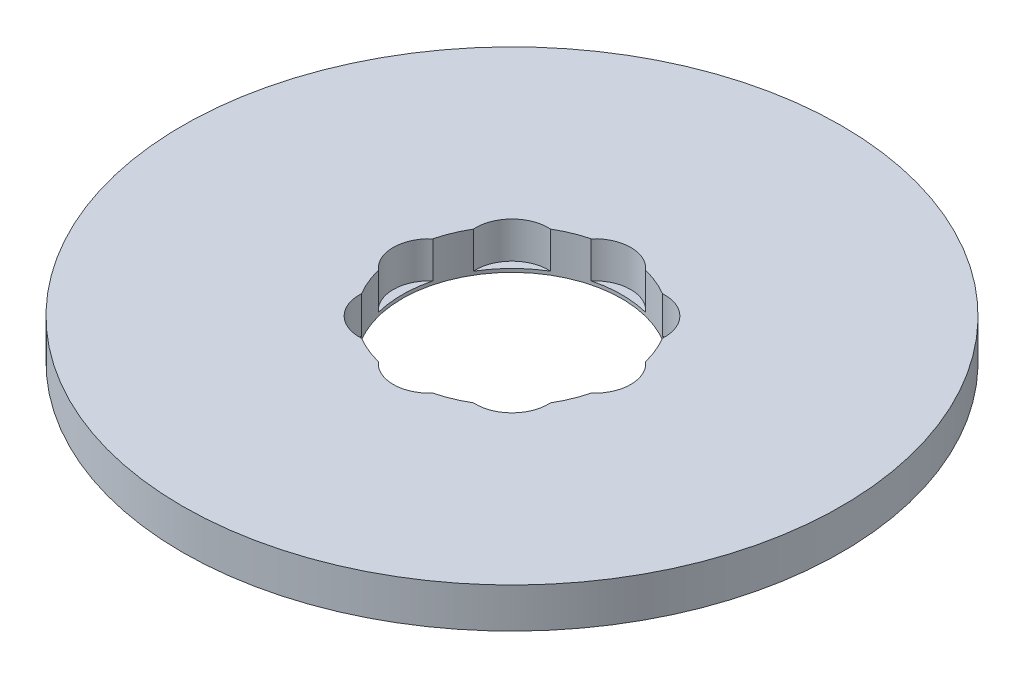
ISO-10303-21;
HEADER;
FILE_DESCRIPTION(('STEP AP214'),'2;1');
FILE_NAME('part.step','',(''),(''),'','','');
FILE_SCHEMA(('AUTOMOTIVE_DESIGN { 1 0 10303 214 1 1 1 1 }'));
ENDSEC;
DATA;
#1=APPLICATION_CONTEXT('core data for automotive mechanical design processes');
#2=APPLICATION_PROTOCOL_DEFINITION('international standard','automotive_design',2000,#1);
#3=PRODUCT_CONTEXT('',#1,'mechanical');
#4=PRODUCT('Part','Part','',(#3));
#5=PRODUCT_RELATED_PRODUCT_CATEGORY('part','',(#4));
#6=PRODUCT_DEFINITION_FORMATION('','',#4);
#7=PRODUCT_DEFINITION_CONTEXT('part definition',#1,'design');
#8=PRODUCT_DEFINITION('design','',#6,#7);
#9=PRODUCT_DEFINITION_SHAPE('','',#8);
#10=(LENGTH_UNIT() NAMED_UNIT(*) SI_UNIT(.MILLI.,.METRE.));
#11=(NAMED_UNIT(*) PLANE_ANGLE_UNIT() SI_UNIT($,.RADIAN.));
#12=(NAMED_UNIT(*) SI_UNIT($,.STERADIAN.) SOLID_ANGLE_UNIT());
#13=UNCERTAINTY_MEASURE_WITH_UNIT(LENGTH_MEASURE(1.E-05),#10,'distance_accuracy_value','');
#14=(GEOMETRIC_REPRESENTATION_CONTEXT(3) GLOBAL_UNCERTAINTY_ASSIGNED_CONTEXT((#13)) GLOBAL_UNIT_ASSIGNED_CONTEXT((#10,
#11,#12)) REPRESENTATION_CONTEXT('',''));
#15=CARTESIAN_POINT('',(0.,0.,0.));
#16=DIRECTION('',(0.,0.,1.));
#17=DIRECTION('',(1.,0.,0.));
#18=AXIS2_PLACEMENT_3D('',#15,#16,#17);
#19=CARTESIAN_POINT('',(0.,10.,0.));
#20=DIRECTION('',(0.,-1.,0.));
#21=DIRECTION('',(0.,0.,-1.));
#22=AXIS2_PLACEMENT_3D('',#19,#20,#21);
#23=CYLINDRICAL_SURFACE('',#22,82.5);
#24=CARTESIAN_POINT('',(0.,10.,0.));
#25=DIRECTION('',(0.,1.,0.));
#26=DIRECTION('',(0.,0.,1.));
#27=AXIS2_PLACEMENT_3D('',#24,#25,#26);
#28=CIRCLE('',#27,82.5);
#29=CARTESIAN_POINT('',(0.,10.,82.5));
#30=VERTEX_POINT('',#29);
#31=EDGE_CURVE('E263',#30,#30,#28,.T.);
#32=ORIENTED_EDGE('',*,*,#31,.F.);
#33=EDGE_LOOP('',(#32));
#34=FACE_BOUND('',#33,.T.);
#35=CARTESIAN_POINT('',(0.,0.,0.));
#36=DIRECTION('',(0.,1.,0.));
#37=DIRECTION('',(0.,0.,1.));
#38=AXIS2_PLACEMENT_3D('',#35,#36,#37);
#39=CIRCLE('',#38,82.5);
#40=CARTESIAN_POINT('',(0.,0.,82.5));
#41=VERTEX_POINT('',#40);
#42=EDGE_CURVE('E256',#41,#41,#39,.T.);
#43=ORIENTED_EDGE('',*,*,#42,.T.);
#44=EDGE_LOOP('',(#43));
#45=FACE_BOUND('',#44,.T.);
#46=ADVANCED_FACE('F39',(#34,#45),#23,.T.);
#47=CARTESIAN_POINT('',(0.,10.,0.));
#48=DIRECTION('',(0.,1.,0.));
#49=DIRECTION('',(0.,0.,1.));
#50=AXIS2_PLACEMENT_3D('',#47,#48,#49);
#51=PLANE('',#50);
#52=CARTESIAN_POINT('',(-14.5853738011501,10.,14.5853738011502));
#53=DIRECTION('',(0.,1.,0.));
#54=DIRECTION('',(0.707106781186549,0.,0.707106781186546));
#55=AXIS2_PLACEMENT_3D('',#52,#53,#54);
#56=CIRCLE('',#55,9.0957152545966);
#57=CARTESIAN_POINT('',(-23.6629507323252,10.,14.0112370131816));
#58=VERTEX_POINT('',#57);
#59=CARTESIAN_POINT('',(-14.0112370131815,10.,23.6629507323253));
#60=VERTEX_POINT('',#59);
#61=EDGE_CURVE('E246',#58,#60,#56,.T.);
#62=ORIENTED_EDGE('',*,*,#61,.F.);
#63=CARTESIAN_POINT('',(0.,10.,0.));
#64=DIRECTION('',(0.,1.,0.));
#65=DIRECTION('',(0.,0.,1.));
#66=AXIS2_PLACEMENT_3D('',#63,#64,#65);
#67=CIRCLE('',#66,27.5);
#68=CARTESIAN_POINT('',(-26.639673630543,10.,6.82479222087777));
#69=VERTEX_POINT('',#68);
#70=EDGE_CURVE('E254',#69,#58,#67,.T.);
#71=ORIENTED_EDGE('',*,*,#70,.F.);
#72=CARTESIAN_POINT('',(-20.6268334418678,10.,0.));
#73=DIRECTION('',(0.,1.,0.));
#74=DIRECTION('',(0.,0.,1.));
#75=AXIS2_PLACEMENT_3D('',#72,#73,#74);
#76=CIRCLE('',#75,9.0957152545966);
#77=CARTESIAN_POINT('',(-26.639673630543,10.,-6.82479222087777));
#78=VERTEX_POINT('',#77);
#79=EDGE_CURVE('E248',#78,#69,#76,.T.);
#80=ORIENTED_EDGE('',*,*,#79,.F.);
#81=CARTESIAN_POINT('',(-23.6629507323254,10.,-14.0112370131812));
#82=VERTEX_POINT('',#81);
#83=EDGE_CURVE('E257',#82,#78,#67,.T.);
#84=ORIENTED_EDGE('',*,*,#83,.F.);
#85=CARTESIAN_POINT('',(-14.5853738011503,10.,-14.58537380115));
#86=DIRECTION('',(0.,1.,0.));
#87=DIRECTION('',(-0.707106781186539,0.,0.707106781186556));
#88=AXIS2_PLACEMENT_3D('',#85,#86,#87);
#89=CIRCLE('',#88,9.0957152545966);
#90=CARTESIAN_POINT('',(-14.0112370131818,10.,-23.6629507323251));
#91=VERTEX_POINT('',#90);
#92=EDGE_CURVE('E58',#91,#82,#89,.T.);
#93=ORIENTED_EDGE('',*,*,#92,.F.);
#94=CARTESIAN_POINT('',(-6.82479222087805,10.,-26.6396736305429));
#95=VERTEX_POINT('',#94);
#96=EDGE_CURVE('E168',#95,#91,#67,.T.);
#97=ORIENTED_EDGE('',*,*,#96,.F.);
#98=CARTESIAN_POINT('',(-2.1605461212512E-13,10.,-20.6268334418678));
#99=DIRECTION('',(0.,1.,0.));
#100=DIRECTION('',(-1.,0.,0.));
#101=AXIS2_PLACEMENT_3D('',#98,#99,#100);
#102=CIRCLE('',#101,9.0957152545966);
#103=CARTESIAN_POINT('',(6.82479222087748,10.,-26.639673630543));
#104=VERTEX_POINT('',#103);
#105=EDGE_CURVE('E165',#104,#95,#102,.T.);
#106=ORIENTED_EDGE('',*,*,#105,.F.);
#107=CARTESIAN_POINT('',(14.0112370131813,10.,-23.6629507323254));
#108=VERTEX_POINT('',#107);
#109=EDGE_CURVE('E604',#108,#104,#67,.T.);
#110=ORIENTED_EDGE('',*,*,#109,.F.);
#111=CARTESIAN_POINT('',(14.58537380115,10.,-14.5853738011503));
#112=DIRECTION('',(0.,1.,0.));
#113=DIRECTION('',(-0.707106781186554,0.,-0.707106781186541));
#114=AXIS2_PLACEMENT_3D('',#111,#112,#113);
#115=CIRCLE('',#114,9.0957152545966);
#116=CARTESIAN_POINT('',(23.6629507323251,10.,-14.0112370131817));
#117=VERTEX_POINT('',#116);
#118=EDGE_CURVE('E224',#117,#108,#115,.T.);
#119=ORIENTED_EDGE('',*,*,#118,.F.);
#120=CARTESIAN_POINT('',(26.639673630543,10.,-6.82479222087776));
#121=VERTEX_POINT('',#120);
#122=EDGE_CURVE('E605',#121,#117,#67,.T.);
#123=ORIENTED_EDGE('',*,*,#122,.F.);
#124=CARTESIAN_POINT('',(20.6268334418678,10.,0.));
#125=DIRECTION('',(0.,1.,0.));
#126=DIRECTION('',(0.,0.,-1.));
#127=AXIS2_PLACEMENT_3D('',#124,#125,#126);
#128=CIRCLE('',#127,9.0957152545966);
#129=CARTESIAN_POINT('',(26.639673630543,10.,6.82479222087776));
#130=VERTEX_POINT('',#129);
#131=EDGE_CURVE('E231',#130,#121,#128,.T.);
#132=ORIENTED_EDGE('',*,*,#131,.F.);
#133=CARTESIAN_POINT('',(23.6629507323253,10.,14.0112370131814));
#134=VERTEX_POINT('',#133);
#135=EDGE_CURVE('E599',#134,#130,#67,.T.);
#136=ORIENTED_EDGE('',*,*,#135,.F.);
#137=CARTESIAN_POINT('',(14.5853738011502,10.,14.5853738011501));
#138=DIRECTION('',(0.,1.,0.));
#139=DIRECTION('',(0.707106781186544,0.,-0.707106781186551));
#140=AXIS2_PLACEMENT_3D('',#137,#138,#139);
#141=CIRCLE('',#140,9.0957152545966);
#142=CARTESIAN_POINT('',(14.0112370131816,10.,23.6629507323252));
#143=VERTEX_POINT('',#142);
#144=EDGE_CURVE('E237',#143,#134,#141,.T.);
#145=ORIENTED_EDGE('',*,*,#144,.F.);
#146=CARTESIAN_POINT('',(6.82479222087786,10.,26.6396736305429));
#147=VERTEX_POINT('',#146);
#148=EDGE_CURVE('E598',#147,#143,#67,.T.);
#149=ORIENTED_EDGE('',*,*,#148,.F.);
#150=CARTESIAN_POINT('',(0.,10.,20.6268334418678));
#151=DIRECTION('',(0.,1.,0.));
#152=DIRECTION('',(1.,0.,0.));
#153=AXIS2_PLACEMENT_3D('',#150,#151,#152);
#154=CIRCLE('',#153,9.0957152545966);
#155=CARTESIAN_POINT('',(-6.82479222087767,10.,26.639673630543));
#156=VERTEX_POINT('',#155);
#157=EDGE_CURVE('E241',#156,#147,#154,.T.);
#158=ORIENTED_EDGE('',*,*,#157,.F.);
#159=EDGE_CURVE('E259',#60,#156,#67,.T.);
#160=ORIENTED_EDGE('',*,*,#159,.F.);
#161=EDGE_LOOP('',(#62,#71,#80,#84,#93,#97,#106,#110,#119,#123,#132,#136,#145,#149,#158,#160));
#162=FACE_BOUND('',#161,.T.);
#163=ORIENTED_EDGE('',*,*,#31,.T.);
#164=EDGE_LOOP('',(#163));
#165=FACE_BOUND('',#164,.T.);
#166=ADVANCED_FACE('F286',(#162,#165),#51,.T.);
#167=CARTESIAN_POINT('',(0.,0.,0.));
#168=DIRECTION('',(0.,1.,0.));
#169=DIRECTION('',(0.,0.,1.));
#170=AXIS2_PLACEMENT_3D('',#167,#168,#169);
#171=PLANE('',#170);
#172=CARTESIAN_POINT('',(0.,0.,0.));
#173=DIRECTION('',(0.,1.,0.));
#174=DIRECTION('',(0.,0.,1.));
#175=AXIS2_PLACEMENT_3D('',#172,#173,#174);
#176=CIRCLE('',#175,27.5);
#177=CARTESIAN_POINT('',(0.,0.,27.5));
#178=VERTEX_POINT('',#177);
#179=EDGE_CURVE('E251',#178,#178,#176,.T.);
#180=ORIENTED_EDGE('',*,*,#179,.T.);
#181=EDGE_LOOP('',(#180));
#182=FACE_BOUND('',#181,.T.);
#183=ORIENTED_EDGE('',*,*,#42,.F.);
#184=EDGE_LOOP('',(#183));
#185=FACE_BOUND('',#184,.T.);
#186=ADVANCED_FACE('F308',(#182,#185),#171,.F.);
#187=CARTESIAN_POINT('',(0.,10.,0.));
#188=DIRECTION('',(0.,-1.,0.));
#189=DIRECTION('',(0.,0.,-1.));
#190=AXIS2_PLACEMENT_3D('',#187,#188,#189);
#191=CYLINDRICAL_SURFACE('',#190,27.5);
#192=DIRECTION('',(0.,1.,0.));
#193=VECTOR('',#192,1.);
#194=CARTESIAN_POINT('',(-23.6629507323252,5.43177677871555,14.0112370131816));
#195=LINE('',#194,#193);
#196=CARTESIAN_POINT('',(-23.6629507323252,0.863553557431104,14.0112370131816));
#197=VERTEX_POINT('',#196);
#198=EDGE_CURVE('E11',#197,#58,#195,.T.);
#199=ORIENTED_EDGE('',*,*,#198,.F.);
#200=CARTESIAN_POINT('',(0.,0.863553557431104,0.));
#201=DIRECTION('',(0.,1.,0.));
#202=DIRECTION('',(0.,0.,1.));
#203=AXIS2_PLACEMENT_3D('',#200,#201,#202);
#204=CIRCLE('',#203,27.5);
#205=CARTESIAN_POINT('',(-14.0112370131815,0.863553557431104,23.6629507323253));
#206=VERTEX_POINT('',#205);
#207=EDGE_CURVE('E157',#197,#206,#204,.T.);
#208=ORIENTED_EDGE('',*,*,#207,.T.);
#209=DIRECTION('',(0.,1.,0.));
#210=VECTOR('',#209,1.);
#211=CARTESIAN_POINT('',(-14.0112370131815,5.43177677871555,23.6629507323253));
#212=LINE('',#211,#210);
#213=EDGE_CURVE('E46',#60,#206,#212,.F.);
#214=ORIENTED_EDGE('',*,*,#213,.F.);
#215=ORIENTED_EDGE('',*,*,#159,.T.);
#216=DIRECTION('',(0.,1.,0.));
#217=VECTOR('',#216,1.);
#218=CARTESIAN_POINT('',(-6.82479222087767,5.43177677871555,26.639673630543));
#219=LINE('',#218,#217);
#220=CARTESIAN_POINT('',(-6.82479222087767,0.863553557431104,26.639673630543));
#221=VERTEX_POINT('',#220);
#222=EDGE_CURVE('E198',#221,#156,#219,.T.);
#223=ORIENTED_EDGE('',*,*,#222,.F.);
#224=CARTESIAN_POINT('',(6.82479222087786,0.863553557431104,26.6396736305429));
#225=VERTEX_POINT('',#224);
#226=EDGE_CURVE('E194',#221,#225,#204,.T.);
#227=ORIENTED_EDGE('',*,*,#226,.T.);
#228=DIRECTION('',(0.,1.,0.));
#229=VECTOR('',#228,1.);
#230=CARTESIAN_POINT('',(6.82479222087786,5.43177677871555,26.6396736305429));
#231=LINE('',#230,#229);
#232=EDGE_CURVE('E192',#147,#225,#231,.F.);
#233=ORIENTED_EDGE('',*,*,#232,.F.);
#234=ORIENTED_EDGE('',*,*,#148,.T.);
#235=DIRECTION('',(0.,1.,0.));
#236=VECTOR('',#235,1.);
#237=CARTESIAN_POINT('',(14.0112370131816,5.43177677871555,23.6629507323252));
#238=LINE('',#237,#236);
#239=CARTESIAN_POINT('',(14.0112370131816,0.863553557431104,23.6629507323252));
#240=VERTEX_POINT('',#239);
#241=EDGE_CURVE('E191',#240,#143,#238,.T.);
#242=ORIENTED_EDGE('',*,*,#241,.F.);
#243=CARTESIAN_POINT('',(23.6629507323253,0.863553557431104,14.0112370131814));
#244=VERTEX_POINT('',#243);
#245=EDGE_CURVE('E189',#240,#244,#204,.T.);
#246=ORIENTED_EDGE('',*,*,#245,.T.);
#247=DIRECTION('',(0.,1.,0.));
#248=VECTOR('',#247,1.);
#249=CARTESIAN_POINT('',(23.6629507323253,5.43177677871555,14.0112370131814));
#250=LINE('',#249,#248);
#251=EDGE_CURVE('E187',#134,#244,#250,.F.);
#252=ORIENTED_EDGE('',*,*,#251,.F.);
#253=ORIENTED_EDGE('',*,*,#135,.T.);
#254=DIRECTION('',(0.,1.,0.));
#255=VECTOR('',#254,1.);
#256=CARTESIAN_POINT('',(26.639673630543,5.43177677871555,6.82479222087776));
#257=LINE('',#256,#255);
#258=CARTESIAN_POINT('',(26.639673630543,0.863553557431104,6.82479222087776));
#259=VERTEX_POINT('',#258);
#260=EDGE_CURVE('E186',#259,#130,#257,.T.);
#261=ORIENTED_EDGE('',*,*,#260,.F.);
#262=CARTESIAN_POINT('',(26.639673630543,0.863553557431104,-6.82479222087776));
#263=VERTEX_POINT('',#262);
#264=EDGE_CURVE('E183',#259,#263,#204,.T.);
#265=ORIENTED_EDGE('',*,*,#264,.T.);
#266=DIRECTION('',(0.,1.,0.));
#267=VECTOR('',#266,1.);
#268=CARTESIAN_POINT('',(26.639673630543,5.43177677871555,-6.82479222087776));
#269=LINE('',#268,#267);
#270=EDGE_CURVE('E181',#121,#263,#269,.F.);
#271=ORIENTED_EDGE('',*,*,#270,.F.);
#272=ORIENTED_EDGE('',*,*,#122,.T.);
#273=DIRECTION('',(0.,1.,0.));
#274=VECTOR('',#273,1.);
#275=CARTESIAN_POINT('',(23.6629507323251,5.43177677871555,-14.0112370131817));
#276=LINE('',#275,#274);
#277=CARTESIAN_POINT('',(23.6629507323251,0.863553557431104,-14.0112370131817));
#278=VERTEX_POINT('',#277);
#279=EDGE_CURVE('E182',#278,#117,#276,.T.);
#280=ORIENTED_EDGE('',*,*,#279,.F.);
#281=CARTESIAN_POINT('',(14.0112370131813,0.863553557431104,-23.6629507323254));
#282=VERTEX_POINT('',#281);
#283=EDGE_CURVE('E179',#278,#282,#204,.T.);
#284=ORIENTED_EDGE('',*,*,#283,.T.);
#285=DIRECTION('',(0.,1.,0.));
#286=VECTOR('',#285,1.);
#287=CARTESIAN_POINT('',(14.0112370131813,5.43177677871555,-23.6629507323254));
#288=LINE('',#287,#286);
#289=EDGE_CURVE('E177',#108,#282,#288,.F.);
#290=ORIENTED_EDGE('',*,*,#289,.F.);
#291=ORIENTED_EDGE('',*,*,#109,.T.);
#292=DIRECTION('',(0.,1.,0.));
#293=VECTOR('',#292,1.);
#294=CARTESIAN_POINT('',(6.82479222087748,5.43177677871555,-26.639673630543));
#295=LINE('',#294,#293);
#296=CARTESIAN_POINT('',(6.82479222087748,0.863553557431104,-26.639673630543));
#297=VERTEX_POINT('',#296);
#298=EDGE_CURVE('E176',#297,#104,#295,.T.);
#299=ORIENTED_EDGE('',*,*,#298,.F.);
#300=CARTESIAN_POINT('',(-6.82479222087805,0.863553557431104,-26.6396736305429));
#301=VERTEX_POINT('',#300);
#302=EDGE_CURVE('E159',#297,#301,#204,.T.);
#303=ORIENTED_EDGE('',*,*,#302,.T.);
#304=DIRECTION('',(0.,1.,0.));
#305=VECTOR('',#304,1.);
#306=CARTESIAN_POINT('',(-6.82479222087804,5.43177677871555,-26.6396736305429));
#307=LINE('',#306,#305);
#308=EDGE_CURVE('E171',#95,#301,#307,.F.);
#309=ORIENTED_EDGE('',*,*,#308,.F.);
#310=ORIENTED_EDGE('',*,*,#96,.T.);
#311=DIRECTION('',(0.,1.,0.));
#312=VECTOR('',#311,1.);
#313=CARTESIAN_POINT('',(-14.0112370131818,5.43177677871555,-23.6629507323251));
#314=LINE('',#313,#312);
#315=CARTESIAN_POINT('',(-14.0112370131818,0.863553557431104,-23.6629507323251));
#316=VERTEX_POINT('',#315);
#317=EDGE_CURVE('E156',#316,#91,#314,.T.);
#318=ORIENTED_EDGE('',*,*,#317,.F.);
#319=CARTESIAN_POINT('',(-23.6629507323254,0.863553557431104,-14.0112370131812));
#320=VERTEX_POINT('',#319);
#321=EDGE_CURVE('E147',#316,#320,#204,.T.);
#322=ORIENTED_EDGE('',*,*,#321,.T.);
#323=DIRECTION('',(0.,1.,0.));
#324=VECTOR('',#323,1.);
#325=CARTESIAN_POINT('',(-23.6629507323254,5.43177677871555,-14.0112370131812));
#326=LINE('',#325,#324);
#327=EDGE_CURVE('E160',#82,#320,#326,.F.);
#328=ORIENTED_EDGE('',*,*,#327,.F.);
#329=ORIENTED_EDGE('',*,*,#83,.T.);
#330=DIRECTION('',(0.,1.,0.));
#331=VECTOR('',#330,1.);
#332=CARTESIAN_POINT('',(-26.639673630543,5.43177677871555,-6.82479222087776));
#333=LINE('',#332,#331);
#334=CARTESIAN_POINT('',(-26.639673630543,0.863553557431104,-6.82479222087777));
#335=VERTEX_POINT('',#334);
#336=EDGE_CURVE('E273',#335,#78,#333,.T.);
#337=ORIENTED_EDGE('',*,*,#336,.F.);
#338=CARTESIAN_POINT('',(0.,0.863553557431104,0.));
#339=DIRECTION('',(0.,1.,0.));
#340=DIRECTION('',(0.,0.,1.));
#341=AXIS2_PLACEMENT_3D('',#338,#339,#340);
#342=CIRCLE('',#341,27.5);
#343=CARTESIAN_POINT('',(-26.639673630543,0.863553557431104,6.82479222087777));
#344=VERTEX_POINT('',#343);
#345=EDGE_CURVE('E266',#335,#344,#342,.T.);
#346=ORIENTED_EDGE('',*,*,#345,.T.);
#347=DIRECTION('',(0.,1.,0.));
#348=VECTOR('',#347,1.);
#349=CARTESIAN_POINT('',(-26.639673630543,5.43177677871555,6.82479222087776));
#350=LINE('',#349,#348);
#351=EDGE_CURVE('E271',#69,#344,#350,.F.);
#352=ORIENTED_EDGE('',*,*,#351,.F.);
#353=ORIENTED_EDGE('',*,*,#70,.T.);
#354=EDGE_LOOP('',(#199,#208,#214,#215,#223,#227,#233,#234,#242,#246,#252,#253,#261,#265,#271,
#272,#280,#284,#290,#291,#299,#303,#309,#310,#318,#322,#328,#329,#337,#346,#352,#353));
#355=FACE_BOUND('',#354,.T.);
#356=ORIENTED_EDGE('',*,*,#179,.F.);
#357=EDGE_LOOP('',(#356));
#358=FACE_BOUND('',#357,.T.);
#359=ADVANCED_FACE('F167',(#355,#358),#191,.F.);
#360=CARTESIAN_POINT('',(-20.6268334418678,0.863553557431104,0.));
#361=DIRECTION('',(0.,1.,0.));
#362=DIRECTION('',(0.,0.,1.));
#363=AXIS2_PLACEMENT_3D('',#360,#361,#362);
#364=CYLINDRICAL_SURFACE('',#363,9.0957152545966);
#365=ORIENTED_EDGE('',*,*,#336,.T.);
#366=ORIENTED_EDGE('',*,*,#79,.T.);
#367=ORIENTED_EDGE('',*,*,#351,.T.);
#368=CARTESIAN_POINT('',(-20.6268334418678,0.863553557431104,0.));
#369=DIRECTION('',(0.,1.,0.));
#370=DIRECTION('',(0.,0.,1.));
#371=AXIS2_PLACEMENT_3D('',#368,#369,#370);
#372=CIRCLE('',#371,9.0957152545966);
#373=EDGE_CURVE('E253',#335,#344,#372,.T.);
#374=ORIENTED_EDGE('',*,*,#373,.F.);
#375=EDGE_LOOP('',(#365,#366,#367,#374));
#376=FACE_BOUND('',#375,.T.);
#377=ADVANCED_FACE('F278',(#376),#364,.F.);
#378=CARTESIAN_POINT('',(-20.6268334418678,0.863553557431104,0.));
#379=DIRECTION('',(0.,1.,0.));
#380=DIRECTION('',(0.,0.,1.));
#381=AXIS2_PLACEMENT_3D('',#378,#379,#380);
#382=PLANE('',#381);
#383=ORIENTED_EDGE('',*,*,#373,.T.);
#384=ORIENTED_EDGE('',*,*,#345,.F.);
#385=EDGE_LOOP('',(#383,#384));
#386=FACE_BOUND('',#385,.T.);
#387=ADVANCED_FACE('F289',(#386),#382,.T.);
#388=CARTESIAN_POINT('',(-14.5853738011503,0.863553557431104,-14.58537380115));
#389=DIRECTION('',(0.,1.,0.));
#390=DIRECTION('',(0.,0.,1.));
#391=AXIS2_PLACEMENT_3D('',#388,#389,#390);
#392=CYLINDRICAL_SURFACE('',#391,9.0957152545966);
#393=ORIENTED_EDGE('',*,*,#317,.T.);
#394=ORIENTED_EDGE('',*,*,#92,.T.);
#395=ORIENTED_EDGE('',*,*,#327,.T.);
#396=CARTESIAN_POINT('',(-14.5853738011503,0.863553557431104,-14.58537380115));
#397=DIRECTION('',(0.,1.,0.));
#398=DIRECTION('',(-0.707106781186539,0.,0.707106781186556));
#399=AXIS2_PLACEMENT_3D('',#396,#397,#398);
#400=CIRCLE('',#399,9.0957152545966);
#401=EDGE_CURVE('E153',#316,#320,#400,.T.);
#402=ORIENTED_EDGE('',*,*,#401,.F.);
#403=EDGE_LOOP('',(#393,#394,#395,#402));
#404=FACE_BOUND('',#403,.T.);
#405=ADVANCED_FACE('F161',(#404),#392,.F.);
#406=CARTESIAN_POINT('',(-14.5853738011501,0.863553557431104,14.5853738011502));
#407=DIRECTION('',(0.,1.,0.));
#408=DIRECTION('',(0.707106781186549,0.,0.707106781186546));
#409=AXIS2_PLACEMENT_3D('',#406,#407,#408);
#410=PLANE('',#409);
#411=ORIENTED_EDGE('',*,*,#401,.T.);
#412=ORIENTED_EDGE('',*,*,#321,.F.);
#413=EDGE_LOOP('',(#411,#412));
#414=FACE_BOUND('',#413,.T.);
#415=ADVANCED_FACE('F155',(#414),#410,.T.);
#416=CARTESIAN_POINT('',(-2.1605461212512E-13,0.863553557431104,-20.6268334418678));
#417=DIRECTION('',(0.,1.,0.));
#418=DIRECTION('',(0.,0.,1.));
#419=AXIS2_PLACEMENT_3D('',#416,#417,#418);
#420=CYLINDRICAL_SURFACE('',#419,9.0957152545966);
#421=ORIENTED_EDGE('',*,*,#298,.T.);
#422=ORIENTED_EDGE('',*,*,#105,.T.);
#423=ORIENTED_EDGE('',*,*,#308,.T.);
#424=CARTESIAN_POINT('',(-2.1605461212512E-13,0.863553557431104,-20.6268334418678));
#425=DIRECTION('',(0.,1.,0.));
#426=DIRECTION('',(-1.,0.,0.));
#427=AXIS2_PLACEMENT_3D('',#424,#425,#426);
#428=CIRCLE('',#427,9.0957152545966);
#429=EDGE_CURVE('E218',#297,#301,#428,.T.);
#430=ORIENTED_EDGE('',*,*,#429,.F.);
#431=EDGE_LOOP('',(#421,#422,#423,#430));
#432=FACE_BOUND('',#431,.T.);
#433=ADVANCED_FACE('F222',(#432),#420,.F.);
#434=ORIENTED_EDGE('',*,*,#429,.T.);
#435=ORIENTED_EDGE('',*,*,#302,.F.);
#436=EDGE_LOOP('',(#434,#435));
#437=FACE_BOUND('',#436,.T.);
#438=ADVANCED_FACE('F217',(#437),#410,.T.);
#439=CARTESIAN_POINT('',(14.58537380115,0.863553557431104,-14.5853738011503));
#440=DIRECTION('',(0.,1.,0.));
#441=DIRECTION('',(0.,0.,1.));
#442=AXIS2_PLACEMENT_3D('',#439,#440,#441);
#443=CYLINDRICAL_SURFACE('',#442,9.0957152545966);
#444=ORIENTED_EDGE('',*,*,#279,.T.);
#445=ORIENTED_EDGE('',*,*,#118,.T.);
#446=ORIENTED_EDGE('',*,*,#289,.T.);
#447=CARTESIAN_POINT('',(14.58537380115,0.863553557431104,-14.5853738011503));
#448=DIRECTION('',(0.,1.,0.));
#449=DIRECTION('',(-0.707106781186554,0.,-0.707106781186541));
#450=AXIS2_PLACEMENT_3D('',#447,#448,#449);
#451=CIRCLE('',#450,9.0957152545966);
#452=EDGE_CURVE('E223',#278,#282,#451,.T.);
#453=ORIENTED_EDGE('',*,*,#452,.F.);
#454=EDGE_LOOP('',(#444,#445,#446,#453));
#455=FACE_BOUND('',#454,.T.);
#456=ADVANCED_FACE('F355',(#455),#443,.F.);
#457=ORIENTED_EDGE('',*,*,#452,.T.);
#458=ORIENTED_EDGE('',*,*,#283,.F.);
#459=EDGE_LOOP('',(#457,#458));
#460=FACE_BOUND('',#459,.T.);
#461=ADVANCED_FACE('F352',(#460),#410,.T.);
#462=CARTESIAN_POINT('',(20.6268334418678,0.863553557431104,0.));
#463=DIRECTION('',(0.,1.,0.));
#464=DIRECTION('',(0.,0.,1.));
#465=AXIS2_PLACEMENT_3D('',#462,#463,#464);
#466=CYLINDRICAL_SURFACE('',#465,9.0957152545966);
#467=ORIENTED_EDGE('',*,*,#260,.T.);
#468=ORIENTED_EDGE('',*,*,#131,.T.);
#469=ORIENTED_EDGE('',*,*,#270,.T.);
#470=CARTESIAN_POINT('',(20.6268334418678,0.863553557431104,0.));
#471=DIRECTION('',(0.,1.,0.));
#472=DIRECTION('',(0.,0.,-1.));
#473=AXIS2_PLACEMENT_3D('',#470,#471,#472);
#474=CIRCLE('',#473,9.0957152545966);
#475=EDGE_CURVE('E232',#259,#263,#474,.T.);
#476=ORIENTED_EDGE('',*,*,#475,.F.);
#477=EDGE_LOOP('',(#467,#468,#469,#476));
#478=FACE_BOUND('',#477,.T.);
#479=ADVANCED_FACE('F369',(#478),#466,.F.);
#480=ORIENTED_EDGE('',*,*,#475,.T.);
#481=ORIENTED_EDGE('',*,*,#264,.F.);
#482=EDGE_LOOP('',(#480,#481));
#483=FACE_BOUND('',#482,.T.);
#484=ADVANCED_FACE('F371',(#483),#410,.T.);
#485=CARTESIAN_POINT('',(14.5853738011502,0.863553557431104,14.5853738011501));
#486=DIRECTION('',(0.,1.,0.));
#487=DIRECTION('',(0.,0.,1.));
#488=AXIS2_PLACEMENT_3D('',#485,#486,#487);
#489=CYLINDRICAL_SURFACE('',#488,9.0957152545966);
#490=ORIENTED_EDGE('',*,*,#241,.T.);
#491=ORIENTED_EDGE('',*,*,#144,.T.);
#492=ORIENTED_EDGE('',*,*,#251,.T.);
#493=CARTESIAN_POINT('',(14.5853738011502,0.863553557431104,14.5853738011501));
#494=DIRECTION('',(0.,1.,0.));
#495=DIRECTION('',(0.707106781186544,0.,-0.707106781186551));
#496=AXIS2_PLACEMENT_3D('',#493,#494,#495);
#497=CIRCLE('',#496,9.0957152545966);
#498=EDGE_CURVE('E236',#240,#244,#497,.T.);
#499=ORIENTED_EDGE('',*,*,#498,.F.);
#500=EDGE_LOOP('',(#490,#491,#492,#499));
#501=FACE_BOUND('',#500,.T.);
#502=ADVANCED_FACE('F390',(#501),#489,.F.);
#503=ORIENTED_EDGE('',*,*,#498,.T.);
#504=ORIENTED_EDGE('',*,*,#245,.F.);
#505=EDGE_LOOP('',(#503,#504));
#506=FACE_BOUND('',#505,.T.);
#507=ADVANCED_FACE('F386',(#506),#410,.T.);
#508=CARTESIAN_POINT('',(0.,0.863553557431104,20.6268334418678));
#509=DIRECTION('',(0.,1.,0.));
#510=DIRECTION('',(0.,0.,1.));
#511=AXIS2_PLACEMENT_3D('',#508,#509,#510);
#512=CYLINDRICAL_SURFACE('',#511,9.0957152545966);
#513=ORIENTED_EDGE('',*,*,#222,.T.);
#514=ORIENTED_EDGE('',*,*,#157,.T.);
#515=ORIENTED_EDGE('',*,*,#232,.T.);
#516=CARTESIAN_POINT('',(0.,0.863553557431104,20.6268334418678));
#517=DIRECTION('',(0.,1.,0.));
#518=DIRECTION('',(1.,0.,0.));
#519=AXIS2_PLACEMENT_3D('',#516,#517,#518);
#520=CIRCLE('',#519,9.0957152545966);
#521=EDGE_CURVE('E242',#221,#225,#520,.T.);
#522=ORIENTED_EDGE('',*,*,#521,.F.);
#523=EDGE_LOOP('',(#513,#514,#515,#522));
#524=FACE_BOUND('',#523,.T.);
#525=ADVANCED_FACE('F403',(#524),#512,.F.);
#526=ORIENTED_EDGE('',*,*,#521,.T.);
#527=ORIENTED_EDGE('',*,*,#226,.F.);
#528=EDGE_LOOP('',(#526,#527));
#529=FACE_BOUND('',#528,.T.);
#530=ADVANCED_FACE('F410',(#529),#410,.T.);
#531=CARTESIAN_POINT('',(-14.5853738011501,0.863553557431104,14.5853738011502));
#532=DIRECTION('',(0.,1.,0.));
#533=DIRECTION('',(0.707106781186549,0.,0.707106781186546));
#534=AXIS2_PLACEMENT_3D('',#531,#532,#533);
#535=CIRCLE('',#534,9.0957152545966);
#536=EDGE_CURVE('E55',#197,#206,#535,.T.);
#537=ORIENTED_EDGE('',*,*,#536,.T.);
#538=ORIENTED_EDGE('',*,*,#207,.F.);
#539=EDGE_LOOP('',(#537,#538));
#540=FACE_BOUND('',#539,.T.);
#541=ADVANCED_FACE('F340',(#540),#410,.T.);
#542=CARTESIAN_POINT('',(-14.5853738011501,0.863553557431104,14.5853738011502));
#543=DIRECTION('',(0.,1.,0.));
#544=DIRECTION('',(0.,0.,1.));
#545=AXIS2_PLACEMENT_3D('',#542,#543,#544);
#546=CYLINDRICAL_SURFACE('',#545,9.0957152545966);
#547=ORIENTED_EDGE('',*,*,#198,.T.);
#548=ORIENTED_EDGE('',*,*,#61,.T.);
#549=ORIENTED_EDGE('',*,*,#213,.T.);
#550=ORIENTED_EDGE('',*,*,#536,.F.);
#551=EDGE_LOOP('',(#547,#548,#549,#550));
#552=FACE_BOUND('',#551,.T.);
#553=ADVANCED_FACE('F431',(#552),#546,.F.);
#554=CLOSED_SHELL('',(#46,#166,#186,#359,#377,#387,#405,#415,#433,#438,#456,#461,#479,#484,#502,
#507,#525,#530,#541,#553));
#555=MANIFOLD_SOLID_BREP('B2',#554);
#556=ADVANCED_BREP_SHAPE_REPRESENTATION('',(#18,#555),#14);
#557=SHAPE_DEFINITION_REPRESENTATION(#9,#556);
ENDSEC;
END-ISO-10303-21;
